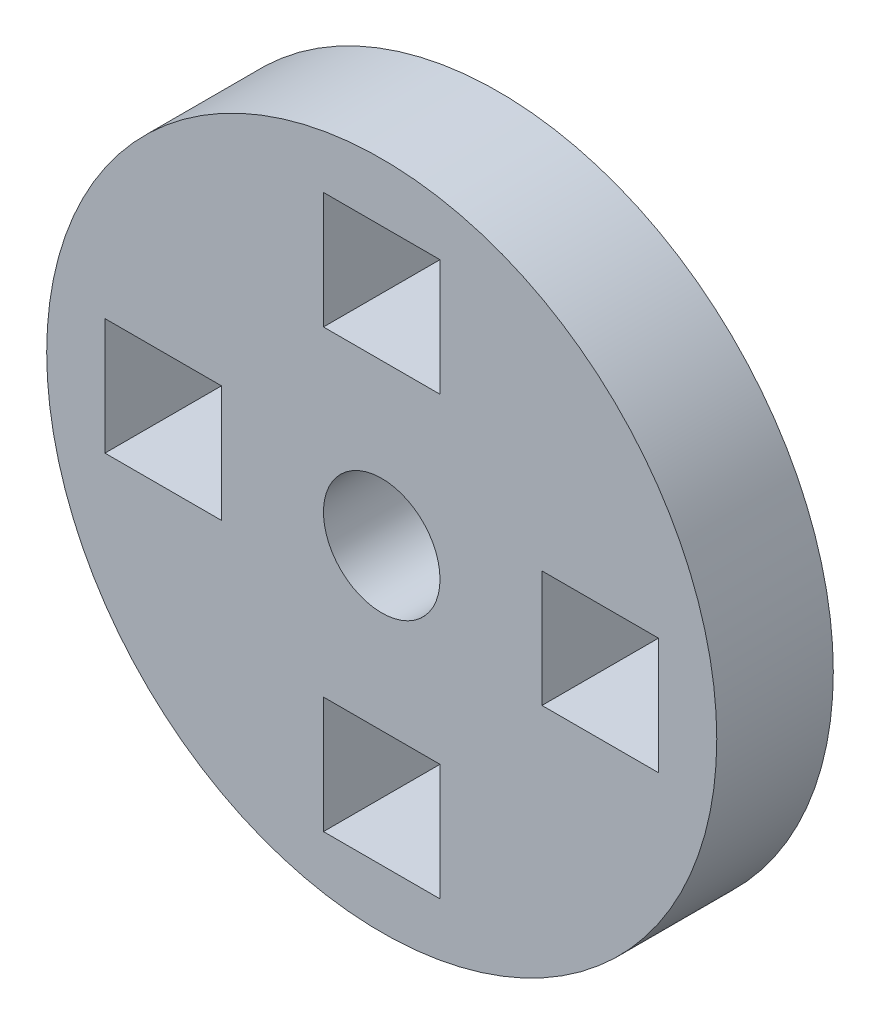
ISO-10303-21;
HEADER;
FILE_DESCRIPTION(('STEP AP214'),'2;1');
FILE_NAME('part.step','',(''),(''),'','','');
FILE_SCHEMA(('AUTOMOTIVE_DESIGN { 1 0 10303 214 1 1 1 1 }'));
ENDSEC;
DATA;
#1=APPLICATION_CONTEXT('core data for automotive mechanical design processes');
#2=APPLICATION_PROTOCOL_DEFINITION('international standard','automotive_design',2000,#1);
#3=PRODUCT_CONTEXT('',#1,'mechanical');
#4=PRODUCT('Part','Part','',(#3));
#5=PRODUCT_RELATED_PRODUCT_CATEGORY('part','',(#4));
#6=PRODUCT_DEFINITION_FORMATION('','',#4);
#7=PRODUCT_DEFINITION_CONTEXT('part definition',#1,'design');
#8=PRODUCT_DEFINITION('design','',#6,#7);
#9=PRODUCT_DEFINITION_SHAPE('','',#8);
#10=(LENGTH_UNIT() NAMED_UNIT(*) SI_UNIT(.MILLI.,.METRE.));
#11=(NAMED_UNIT(*) PLANE_ANGLE_UNIT() SI_UNIT($,.RADIAN.));
#12=(NAMED_UNIT(*) SI_UNIT($,.STERADIAN.) SOLID_ANGLE_UNIT());
#13=UNCERTAINTY_MEASURE_WITH_UNIT(LENGTH_MEASURE(1.E-05),#10,'distance_accuracy_value','');
#14=(GEOMETRIC_REPRESENTATION_CONTEXT(3) GLOBAL_UNCERTAINTY_ASSIGNED_CONTEXT((#13)) GLOBAL_UNIT_ASSIGNED_CONTEXT((#10,
#11,#12)) REPRESENTATION_CONTEXT('',''));
#15=CARTESIAN_POINT('',(0.,0.,0.));
#16=DIRECTION('',(0.,0.,1.));
#17=DIRECTION('',(1.,0.,0.));
#18=AXIS2_PLACEMENT_3D('',#15,#16,#17);
#19=CARTESIAN_POINT('',(0.,0.,4.));
#20=DIRECTION('',(0.,0.,1.));
#21=DIRECTION('',(1.,0.,0.));
#22=AXIS2_PLACEMENT_3D('',#19,#20,#21);
#23=PLANE('',#22);
#24=CARTESIAN_POINT('',(0.,0.,4.));
#25=DIRECTION('',(0.,0.,1.));
#26=DIRECTION('',(1.,0.,0.));
#27=AXIS2_PLACEMENT_3D('',#24,#25,#26);
#28=CIRCLE('',#27,2.);
#29=CARTESIAN_POINT('',(2.,0.,4.));
#30=VERTEX_POINT('',#29);
#31=EDGE_CURVE('E564',#30,#30,#28,.T.);
#32=ORIENTED_EDGE('',*,*,#31,.F.);
#33=EDGE_LOOP('',(#32));
#34=FACE_BOUND('',#33,.T.);
#35=CARTESIAN_POINT('',(0.,0.,4.));
#36=DIRECTION('',(0.,0.,1.));
#37=DIRECTION('',(1.,0.,0.));
#38=AXIS2_PLACEMENT_3D('',#35,#36,#37);
#39=CIRCLE('',#38,11.5);
#40=CARTESIAN_POINT('',(11.5,0.,4.));
#41=VERTEX_POINT('',#40);
#42=EDGE_CURVE('E11',#41,#41,#39,.T.);
#43=ORIENTED_EDGE('',*,*,#42,.T.);
#44=EDGE_LOOP('',(#43));
#45=FACE_BOUND('',#44,.T.);
#46=DIRECTION('',(1.,0.,0.));
#47=VECTOR('',#46,1.);
#48=CARTESIAN_POINT('',(-2.,5.5,4.));
#49=LINE('',#48,#47);
#50=CARTESIAN_POINT('',(-2.,5.5,4.));
#51=VERTEX_POINT('',#50);
#52=CARTESIAN_POINT('',(2.,5.5,4.));
#53=VERTEX_POINT('',#52);
#54=EDGE_CURVE('E291',#51,#53,#49,.T.);
#55=ORIENTED_EDGE('',*,*,#54,.F.);
#56=DIRECTION('',(0.,-1.,0.));
#57=VECTOR('',#56,1.);
#58=CARTESIAN_POINT('',(-2.,9.5,4.));
#59=LINE('',#58,#57);
#60=CARTESIAN_POINT('',(-2.,9.5,4.));
#61=VERTEX_POINT('',#60);
#62=EDGE_CURVE('E288',#61,#51,#59,.T.);
#63=ORIENTED_EDGE('',*,*,#62,.F.);
#64=DIRECTION('',(-1.,0.,0.));
#65=VECTOR('',#64,1.);
#66=CARTESIAN_POINT('',(-2.,9.5,4.));
#67=LINE('',#66,#65);
#68=CARTESIAN_POINT('',(2.,9.5,4.));
#69=VERTEX_POINT('',#68);
#70=EDGE_CURVE('E299',#69,#61,#67,.T.);
#71=ORIENTED_EDGE('',*,*,#70,.F.);
#72=DIRECTION('',(0.,1.,0.));
#73=VECTOR('',#72,1.);
#74=CARTESIAN_POINT('',(2.,9.5,4.));
#75=LINE('',#74,#73);
#76=EDGE_CURVE('E295',#53,#69,#75,.T.);
#77=ORIENTED_EDGE('',*,*,#76,.F.);
#78=EDGE_LOOP('',(#55,#63,#71,#77));
#79=FACE_BOUND('',#78,.T.);
#80=DIRECTION('',(1.,0.,0.));
#81=VECTOR('',#80,1.);
#82=CARTESIAN_POINT('',(-2.,-9.5,4.));
#83=LINE('',#82,#81);
#84=CARTESIAN_POINT('',(-2.,-9.5,4.));
#85=VERTEX_POINT('',#84);
#86=CARTESIAN_POINT('',(2.,-9.5,4.));
#87=VERTEX_POINT('',#86);
#88=EDGE_CURVE('E248',#85,#87,#83,.T.);
#89=ORIENTED_EDGE('',*,*,#88,.F.);
#90=DIRECTION('',(0.,-1.,0.));
#91=VECTOR('',#90,1.);
#92=CARTESIAN_POINT('',(-2.,-5.5,4.));
#93=LINE('',#92,#91);
#94=CARTESIAN_POINT('',(-2.,-5.5,4.));
#95=VERTEX_POINT('',#94);
#96=EDGE_CURVE('E245',#95,#85,#93,.T.);
#97=ORIENTED_EDGE('',*,*,#96,.F.);
#98=DIRECTION('',(-1.,0.,0.));
#99=VECTOR('',#98,1.);
#100=CARTESIAN_POINT('',(-2.,-5.5,4.));
#101=LINE('',#100,#99);
#102=CARTESIAN_POINT('',(2.,-5.5,4.));
#103=VERTEX_POINT('',#102);
#104=EDGE_CURVE('E256',#103,#95,#101,.T.);
#105=ORIENTED_EDGE('',*,*,#104,.F.);
#106=DIRECTION('',(0.,1.,0.));
#107=VECTOR('',#106,1.);
#108=CARTESIAN_POINT('',(2.,-5.5,4.));
#109=LINE('',#108,#107);
#110=EDGE_CURVE('E252',#87,#103,#109,.T.);
#111=ORIENTED_EDGE('',*,*,#110,.F.);
#112=EDGE_LOOP('',(#89,#97,#105,#111));
#113=FACE_BOUND('',#112,.T.);
#114=DIRECTION('',(-1.,0.,0.));
#115=VECTOR('',#114,1.);
#116=CARTESIAN_POINT('',(9.50000000000013,2.00000000000075,4.));
#117=LINE('',#116,#115);
#118=CARTESIAN_POINT('',(9.50000000000013,2.00000000000075,4.));
#119=VERTEX_POINT('',#118);
#120=CARTESIAN_POINT('',(5.50000000000013,2.00000000000061,4.));
#121=VERTEX_POINT('',#120);
#122=EDGE_CURVE('E205',#119,#121,#117,.T.);
#123=ORIENTED_EDGE('',*,*,#122,.F.);
#124=DIRECTION('',(0.,1.,0.));
#125=VECTOR('',#124,1.);
#126=CARTESIAN_POINT('',(9.50000000000013,2.00000000000075,4.));
#127=LINE('',#126,#125);
#128=CARTESIAN_POINT('',(9.50000000000027,-1.99999999999925,4.));
#129=VERTEX_POINT('',#128);
#130=EDGE_CURVE('E202',#129,#119,#127,.T.);
#131=ORIENTED_EDGE('',*,*,#130,.F.);
#132=DIRECTION('',(1.,0.,0.));
#133=VECTOR('',#132,1.);
#134=CARTESIAN_POINT('',(9.50000000000027,-1.99999999999925,4.));
#135=LINE('',#134,#133);
#136=CARTESIAN_POINT('',(5.50000000000027,-1.99999999999939,4.));
#137=VERTEX_POINT('',#136);
#138=EDGE_CURVE('E213',#137,#129,#135,.T.);
#139=ORIENTED_EDGE('',*,*,#138,.F.);
#140=DIRECTION('',(0.,-1.,0.));
#141=VECTOR('',#140,1.);
#142=CARTESIAN_POINT('',(5.50000000000013,2.00000000000061,4.));
#143=LINE('',#142,#141);
#144=EDGE_CURVE('E209',#121,#137,#143,.T.);
#145=ORIENTED_EDGE('',*,*,#144,.F.);
#146=EDGE_LOOP('',(#123,#131,#139,#145));
#147=FACE_BOUND('',#146,.T.);
#148=DIRECTION('',(-1.,0.,0.));
#149=VECTOR('',#148,1.);
#150=CARTESIAN_POINT('',(-5.49999999999999,2.00000000000002,4.));
#151=LINE('',#150,#149);
#152=CARTESIAN_POINT('',(-5.49999999999999,2.00000000000002,4.));
#153=VERTEX_POINT('',#152);
#154=CARTESIAN_POINT('',(-9.49999999999999,2.00000000000003,4.));
#155=VERTEX_POINT('',#154);
#156=EDGE_CURVE('E161',#153,#155,#151,.T.);
#157=ORIENTED_EDGE('',*,*,#156,.F.);
#158=DIRECTION('',(0.,1.,0.));
#159=VECTOR('',#158,1.);
#160=CARTESIAN_POINT('',(-5.49999999999999,2.00000000000002,4.));
#161=LINE('',#160,#159);
#162=CARTESIAN_POINT('',(-5.49999999999973,-1.99999999999977,4.));
#163=VERTEX_POINT('',#162);
#164=EDGE_CURVE('E152',#163,#153,#161,.T.);
#165=ORIENTED_EDGE('',*,*,#164,.F.);
#166=DIRECTION('',(1.,0.,0.));
#167=VECTOR('',#166,1.);
#168=CARTESIAN_POINT('',(-5.49999999999973,-1.99999999999977,4.));
#169=LINE('',#168,#167);
#170=CARTESIAN_POINT('',(-9.49999999999973,-1.99999999999991,4.));
#171=VERTEX_POINT('',#170);
#172=EDGE_CURVE('E178',#171,#163,#169,.T.);
#173=ORIENTED_EDGE('',*,*,#172,.F.);
#174=DIRECTION('',(0.,-1.,0.));
#175=VECTOR('',#174,1.);
#176=CARTESIAN_POINT('',(-9.49999999999999,2.00000000000003,4.));
#177=LINE('',#176,#175);
#178=EDGE_CURVE('E174',#155,#171,#177,.T.);
#179=ORIENTED_EDGE('',*,*,#178,.F.);
#180=EDGE_LOOP('',(#157,#165,#173,#179));
#181=FACE_BOUND('',#180,.T.);
#182=ADVANCED_FACE('F38',(#34,#45,#79,#113,#147,#181),#23,.T.);
#183=CARTESIAN_POINT('',(0.,0.,0.));
#184=DIRECTION('',(0.,0.,1.));
#185=DIRECTION('',(1.,0.,0.));
#186=AXIS2_PLACEMENT_3D('',#183,#184,#185);
#187=PLANE('',#186);
#188=CARTESIAN_POINT('',(0.,0.,0.));
#189=DIRECTION('',(0.,0.,1.));
#190=DIRECTION('',(1.,0.,0.));
#191=AXIS2_PLACEMENT_3D('',#188,#189,#190);
#192=CIRCLE('',#191,2.);
#193=CARTESIAN_POINT('',(2.,0.,0.));
#194=VERTEX_POINT('',#193);
#195=EDGE_CURVE('E186',#194,#194,#192,.T.);
#196=ORIENTED_EDGE('',*,*,#195,.T.);
#197=EDGE_LOOP('',(#196));
#198=FACE_BOUND('',#197,.T.);
#199=DIRECTION('',(0.,1.,0.));
#200=VECTOR('',#199,1.);
#201=CARTESIAN_POINT('',(9.50000000000013,2.00000000000075,0.));
#202=LINE('',#201,#200);
#203=CARTESIAN_POINT('',(9.50000000000027,-1.99999999999925,0.));
#204=VERTEX_POINT('',#203);
#205=CARTESIAN_POINT('',(9.50000000000013,2.00000000000075,0.));
#206=VERTEX_POINT('',#205);
#207=EDGE_CURVE('E170',#204,#206,#202,.T.);
#208=ORIENTED_EDGE('',*,*,#207,.T.);
#209=DIRECTION('',(-1.,0.,0.));
#210=VECTOR('',#209,1.);
#211=CARTESIAN_POINT('',(9.50000000000013,2.00000000000075,0.));
#212=LINE('',#211,#210);
#213=CARTESIAN_POINT('',(5.50000000000013,2.00000000000061,0.));
#214=VERTEX_POINT('',#213);
#215=EDGE_CURVE('E220',#206,#214,#212,.T.);
#216=ORIENTED_EDGE('',*,*,#215,.T.);
#217=DIRECTION('',(0.,-1.,0.));
#218=VECTOR('',#217,1.);
#219=CARTESIAN_POINT('',(5.50000000000013,2.00000000000061,0.));
#220=LINE('',#219,#218);
#221=CARTESIAN_POINT('',(5.50000000000027,-1.99999999999939,0.));
#222=VERTEX_POINT('',#221);
#223=EDGE_CURVE('E224',#214,#222,#220,.T.);
#224=ORIENTED_EDGE('',*,*,#223,.T.);
#225=DIRECTION('',(1.,0.,0.));
#226=VECTOR('',#225,1.);
#227=CARTESIAN_POINT('',(9.50000000000027,-1.99999999999925,0.));
#228=LINE('',#227,#226);
#229=EDGE_CURVE('E206',#222,#204,#228,.T.);
#230=ORIENTED_EDGE('',*,*,#229,.T.);
#231=EDGE_LOOP('',(#208,#216,#224,#230));
#232=FACE_BOUND('',#231,.T.);
#233=DIRECTION('',(0.,-1.,0.));
#234=VECTOR('',#233,1.);
#235=CARTESIAN_POINT('',(-2.,9.5,0.));
#236=LINE('',#235,#234);
#237=CARTESIAN_POINT('',(-2.,9.5,0.));
#238=VERTEX_POINT('',#237);
#239=CARTESIAN_POINT('',(-2.,5.5,0.));
#240=VERTEX_POINT('',#239);
#241=EDGE_CURVE('E287',#238,#240,#236,.T.);
#242=ORIENTED_EDGE('',*,*,#241,.T.);
#243=DIRECTION('',(1.,0.,0.));
#244=VECTOR('',#243,1.);
#245=CARTESIAN_POINT('',(-2.,5.5,0.));
#246=LINE('',#245,#244);
#247=CARTESIAN_POINT('',(2.,5.5,0.));
#248=VERTEX_POINT('',#247);
#249=EDGE_CURVE('E306',#240,#248,#246,.T.);
#250=ORIENTED_EDGE('',*,*,#249,.T.);
#251=DIRECTION('',(0.,1.,0.));
#252=VECTOR('',#251,1.);
#253=CARTESIAN_POINT('',(2.,9.5,0.));
#254=LINE('',#253,#252);
#255=CARTESIAN_POINT('',(2.,9.5,0.));
#256=VERTEX_POINT('',#255);
#257=EDGE_CURVE('E310',#248,#256,#254,.T.);
#258=ORIENTED_EDGE('',*,*,#257,.T.);
#259=DIRECTION('',(-1.,0.,0.));
#260=VECTOR('',#259,1.);
#261=CARTESIAN_POINT('',(-2.,9.5,0.));
#262=LINE('',#261,#260);
#263=EDGE_CURVE('E292',#256,#238,#262,.T.);
#264=ORIENTED_EDGE('',*,*,#263,.T.);
#265=EDGE_LOOP('',(#242,#250,#258,#264));
#266=FACE_BOUND('',#265,.T.);
#267=CARTESIAN_POINT('',(0.,0.,0.));
#268=DIRECTION('',(0.,0.,1.));
#269=DIRECTION('',(1.,0.,0.));
#270=AXIS2_PLACEMENT_3D('',#267,#268,#269);
#271=CIRCLE('',#270,11.5);
#272=CARTESIAN_POINT('',(11.5,0.,0.));
#273=VERTEX_POINT('',#272);
#274=EDGE_CURVE('E42',#273,#273,#271,.T.);
#275=ORIENTED_EDGE('',*,*,#274,.F.);
#276=EDGE_LOOP('',(#275));
#277=FACE_BOUND('',#276,.T.);
#278=DIRECTION('',(0.,-1.,0.));
#279=VECTOR('',#278,1.);
#280=CARTESIAN_POINT('',(-2.,-5.5,0.));
#281=LINE('',#280,#279);
#282=CARTESIAN_POINT('',(-2.,-5.5,0.));
#283=VERTEX_POINT('',#282);
#284=CARTESIAN_POINT('',(-2.,-9.5,0.));
#285=VERTEX_POINT('',#284);
#286=EDGE_CURVE('E244',#283,#285,#281,.T.);
#287=ORIENTED_EDGE('',*,*,#286,.T.);
#288=DIRECTION('',(1.,0.,0.));
#289=VECTOR('',#288,1.);
#290=CARTESIAN_POINT('',(-2.,-9.5,0.));
#291=LINE('',#290,#289);
#292=CARTESIAN_POINT('',(2.,-9.5,0.));
#293=VERTEX_POINT('',#292);
#294=EDGE_CURVE('E263',#285,#293,#291,.T.);
#295=ORIENTED_EDGE('',*,*,#294,.T.);
#296=DIRECTION('',(0.,1.,0.));
#297=VECTOR('',#296,1.);
#298=CARTESIAN_POINT('',(2.,-5.5,0.));
#299=LINE('',#298,#297);
#300=CARTESIAN_POINT('',(2.,-5.5,0.));
#301=VERTEX_POINT('',#300);
#302=EDGE_CURVE('E267',#293,#301,#299,.T.);
#303=ORIENTED_EDGE('',*,*,#302,.T.);
#304=DIRECTION('',(-1.,0.,0.));
#305=VECTOR('',#304,1.);
#306=CARTESIAN_POINT('',(-2.,-5.5,0.));
#307=LINE('',#306,#305);
#308=EDGE_CURVE('E249',#301,#283,#307,.T.);
#309=ORIENTED_EDGE('',*,*,#308,.T.);
#310=EDGE_LOOP('',(#287,#295,#303,#309));
#311=FACE_BOUND('',#310,.T.);
#312=DIRECTION('',(0.,1.,0.));
#313=VECTOR('',#312,1.);
#314=CARTESIAN_POINT('',(-5.49999999999999,2.00000000000002,0.));
#315=LINE('',#314,#313);
#316=CARTESIAN_POINT('',(-5.49999999999973,-1.99999999999977,0.));
#317=VERTEX_POINT('',#316);
#318=CARTESIAN_POINT('',(-5.49999999999999,2.00000000000002,0.));
#319=VERTEX_POINT('',#318);
#320=EDGE_CURVE('E62',#317,#319,#315,.T.);
#321=ORIENTED_EDGE('',*,*,#320,.T.);
#322=DIRECTION('',(-1.,0.,0.));
#323=VECTOR('',#322,1.);
#324=CARTESIAN_POINT('',(-5.49999999999999,2.00000000000002,0.));
#325=LINE('',#324,#323);
#326=CARTESIAN_POINT('',(-9.49999999999999,2.00000000000003,0.));
#327=VERTEX_POINT('',#326);
#328=EDGE_CURVE('E168',#319,#327,#325,.T.);
#329=ORIENTED_EDGE('',*,*,#328,.T.);
#330=DIRECTION('',(0.,-1.,0.));
#331=VECTOR('',#330,1.);
#332=CARTESIAN_POINT('',(-9.49999999999999,2.00000000000003,0.));
#333=LINE('',#332,#331);
#334=CARTESIAN_POINT('',(-9.49999999999973,-1.99999999999991,0.));
#335=VERTEX_POINT('',#334);
#336=EDGE_CURVE('E189',#327,#335,#333,.T.);
#337=ORIENTED_EDGE('',*,*,#336,.T.);
#338=DIRECTION('',(1.,0.,0.));
#339=VECTOR('',#338,1.);
#340=CARTESIAN_POINT('',(-5.49999999999973,-1.99999999999977,0.));
#341=LINE('',#340,#339);
#342=EDGE_CURVE('E162',#335,#317,#341,.T.);
#343=ORIENTED_EDGE('',*,*,#342,.T.);
#344=EDGE_LOOP('',(#321,#329,#337,#343));
#345=FACE_BOUND('',#344,.T.);
#346=ADVANCED_FACE('F336',(#198,#232,#266,#277,#311,#345),#187,.F.);
#347=CARTESIAN_POINT('',(0.,0.,4.));
#348=DIRECTION('',(0.,0.,-1.));
#349=DIRECTION('',(-1.,0.,0.));
#350=AXIS2_PLACEMENT_3D('',#347,#348,#349);
#351=CYLINDRICAL_SURFACE('',#350,11.5);
#352=ORIENTED_EDGE('',*,*,#42,.F.);
#353=EDGE_LOOP('',(#352));
#354=FACE_BOUND('',#353,.T.);
#355=ORIENTED_EDGE('',*,*,#274,.T.);
#356=EDGE_LOOP('',(#355));
#357=FACE_BOUND('',#356,.T.);
#358=ADVANCED_FACE('F40',(#354,#357),#351,.T.);
#359=CARTESIAN_POINT('',(-2.,9.5,4.));
#360=DIRECTION('',(1.,0.,0.));
#361=DIRECTION('',(0.,1.,0.));
#362=AXIS2_PLACEMENT_3D('',#359,#360,#361);
#363=PLANE('',#362);
#364=ORIENTED_EDGE('',*,*,#241,.F.);
#365=DIRECTION('',(0.,0.,-1.));
#366=VECTOR('',#365,1.);
#367=CARTESIAN_POINT('',(-2.,9.5,4.));
#368=LINE('',#367,#366);
#369=EDGE_CURVE('E302',#61,#238,#368,.T.);
#370=ORIENTED_EDGE('',*,*,#369,.F.);
#371=ORIENTED_EDGE('',*,*,#62,.T.);
#372=DIRECTION('',(0.,0.,-1.));
#373=VECTOR('',#372,1.);
#374=CARTESIAN_POINT('',(-2.,5.5,4.));
#375=LINE('',#374,#373);
#376=EDGE_CURVE('E326',#51,#240,#375,.T.);
#377=ORIENTED_EDGE('',*,*,#376,.T.);
#378=EDGE_LOOP('',(#364,#370,#371,#377));
#379=FACE_BOUND('',#378,.T.);
#380=ADVANCED_FACE('F363',(#379),#363,.T.);
#381=CARTESIAN_POINT('',(-2.,5.5,4.));
#382=DIRECTION('',(0.,1.,0.));
#383=DIRECTION('',(-1.,0.,0.));
#384=AXIS2_PLACEMENT_3D('',#381,#382,#383);
#385=PLANE('',#384);
#386=ORIENTED_EDGE('',*,*,#249,.F.);
#387=ORIENTED_EDGE('',*,*,#376,.F.);
#388=ORIENTED_EDGE('',*,*,#54,.T.);
#389=DIRECTION('',(0.,0.,-1.));
#390=VECTOR('',#389,1.);
#391=CARTESIAN_POINT('',(2.,5.5,4.));
#392=LINE('',#391,#390);
#393=EDGE_CURVE('E323',#53,#248,#392,.T.);
#394=ORIENTED_EDGE('',*,*,#393,.T.);
#395=EDGE_LOOP('',(#386,#387,#388,#394));
#396=FACE_BOUND('',#395,.T.);
#397=ADVANCED_FACE('F366',(#396),#385,.T.);
#398=CARTESIAN_POINT('',(2.,9.5,4.));
#399=DIRECTION('',(-1.,0.,0.));
#400=DIRECTION('',(0.,-1.,0.));
#401=AXIS2_PLACEMENT_3D('',#398,#399,#400);
#402=PLANE('',#401);
#403=ORIENTED_EDGE('',*,*,#257,.F.);
#404=ORIENTED_EDGE('',*,*,#393,.F.);
#405=ORIENTED_EDGE('',*,*,#76,.T.);
#406=DIRECTION('',(0.,0.,-1.));
#407=VECTOR('',#406,1.);
#408=CARTESIAN_POINT('',(2.,9.5,4.));
#409=LINE('',#408,#407);
#410=EDGE_CURVE('E320',#69,#256,#409,.T.);
#411=ORIENTED_EDGE('',*,*,#410,.T.);
#412=EDGE_LOOP('',(#403,#404,#405,#411));
#413=FACE_BOUND('',#412,.T.);
#414=ADVANCED_FACE('F369',(#413),#402,.T.);
#415=CARTESIAN_POINT('',(-2.,9.5,4.));
#416=DIRECTION('',(0.,-1.,0.));
#417=DIRECTION('',(0.,0.,-1.));
#418=AXIS2_PLACEMENT_3D('',#415,#416,#417);
#419=PLANE('',#418);
#420=ORIENTED_EDGE('',*,*,#263,.F.);
#421=ORIENTED_EDGE('',*,*,#410,.F.);
#422=ORIENTED_EDGE('',*,*,#70,.T.);
#423=ORIENTED_EDGE('',*,*,#369,.T.);
#424=EDGE_LOOP('',(#420,#421,#422,#423));
#425=FACE_BOUND('',#424,.T.);
#426=ADVANCED_FACE('F373',(#425),#419,.T.);
#427=CARTESIAN_POINT('',(-2.,-5.5,4.));
#428=DIRECTION('',(1.,0.,0.));
#429=DIRECTION('',(0.,1.,0.));
#430=AXIS2_PLACEMENT_3D('',#427,#428,#429);
#431=PLANE('',#430);
#432=ORIENTED_EDGE('',*,*,#286,.F.);
#433=DIRECTION('',(0.,0.,-1.));
#434=VECTOR('',#433,1.);
#435=CARTESIAN_POINT('',(-2.,-5.5,4.));
#436=LINE('',#435,#434);
#437=EDGE_CURVE('E259',#95,#283,#436,.T.);
#438=ORIENTED_EDGE('',*,*,#437,.F.);
#439=ORIENTED_EDGE('',*,*,#96,.T.);
#440=DIRECTION('',(0.,0.,-1.));
#441=VECTOR('',#440,1.);
#442=CARTESIAN_POINT('',(-2.,-9.5,4.));
#443=LINE('',#442,#441);
#444=EDGE_CURVE('E283',#85,#285,#443,.T.);
#445=ORIENTED_EDGE('',*,*,#444,.T.);
#446=EDGE_LOOP('',(#432,#438,#439,#445));
#447=FACE_BOUND('',#446,.T.);
#448=ADVANCED_FACE('F377',(#447),#431,.T.);
#449=CARTESIAN_POINT('',(-2.,-9.5,4.));
#450=DIRECTION('',(0.,1.,0.));
#451=DIRECTION('',(0.,0.,1.));
#452=AXIS2_PLACEMENT_3D('',#449,#450,#451);
#453=PLANE('',#452);
#454=ORIENTED_EDGE('',*,*,#294,.F.);
#455=ORIENTED_EDGE('',*,*,#444,.F.);
#456=ORIENTED_EDGE('',*,*,#88,.T.);
#457=DIRECTION('',(0.,0.,-1.));
#458=VECTOR('',#457,1.);
#459=CARTESIAN_POINT('',(2.,-9.5,4.));
#460=LINE('',#459,#458);
#461=EDGE_CURVE('E280',#87,#293,#460,.T.);
#462=ORIENTED_EDGE('',*,*,#461,.T.);
#463=EDGE_LOOP('',(#454,#455,#456,#462));
#464=FACE_BOUND('',#463,.T.);
#465=ADVANCED_FACE('F381',(#464),#453,.T.);
#466=CARTESIAN_POINT('',(2.,-5.5,4.));
#467=DIRECTION('',(-1.,0.,0.));
#468=DIRECTION('',(0.,-1.,0.));
#469=AXIS2_PLACEMENT_3D('',#466,#467,#468);
#470=PLANE('',#469);
#471=ORIENTED_EDGE('',*,*,#302,.F.);
#472=ORIENTED_EDGE('',*,*,#461,.F.);
#473=ORIENTED_EDGE('',*,*,#110,.T.);
#474=DIRECTION('',(0.,0.,-1.));
#475=VECTOR('',#474,1.);
#476=CARTESIAN_POINT('',(2.,-5.5,4.));
#477=LINE('',#476,#475);
#478=EDGE_CURVE('E277',#103,#301,#477,.T.);
#479=ORIENTED_EDGE('',*,*,#478,.T.);
#480=EDGE_LOOP('',(#471,#472,#473,#479));
#481=FACE_BOUND('',#480,.T.);
#482=ADVANCED_FACE('F385',(#481),#470,.T.);
#483=CARTESIAN_POINT('',(-2.,-5.5,4.));
#484=DIRECTION('',(0.,-1.,0.));
#485=DIRECTION('',(1.,0.,0.));
#486=AXIS2_PLACEMENT_3D('',#483,#484,#485);
#487=PLANE('',#486);
#488=ORIENTED_EDGE('',*,*,#308,.F.);
#489=ORIENTED_EDGE('',*,*,#478,.F.);
#490=ORIENTED_EDGE('',*,*,#104,.T.);
#491=ORIENTED_EDGE('',*,*,#437,.T.);
#492=EDGE_LOOP('',(#488,#489,#490,#491));
#493=FACE_BOUND('',#492,.T.);
#494=ADVANCED_FACE('F389',(#493),#487,.T.);
#495=CARTESIAN_POINT('',(9.50000000000013,2.00000000000075,4.));
#496=DIRECTION('',(-1.,0.,0.));
#497=DIRECTION('',(0.,-1.,0.));
#498=AXIS2_PLACEMENT_3D('',#495,#496,#497);
#499=PLANE('',#498);
#500=ORIENTED_EDGE('',*,*,#207,.F.);
#501=DIRECTION('',(0.,0.,-1.));
#502=VECTOR('',#501,1.);
#503=CARTESIAN_POINT('',(9.50000000000027,-1.99999999999925,4.));
#504=LINE('',#503,#502);
#505=EDGE_CURVE('E216',#129,#204,#504,.T.);
#506=ORIENTED_EDGE('',*,*,#505,.F.);
#507=ORIENTED_EDGE('',*,*,#130,.T.);
#508=DIRECTION('',(0.,0.,-1.));
#509=VECTOR('',#508,1.);
#510=CARTESIAN_POINT('',(9.50000000000013,2.00000000000075,4.));
#511=LINE('',#510,#509);
#512=EDGE_CURVE('E240',#119,#206,#511,.T.);
#513=ORIENTED_EDGE('',*,*,#512,.T.);
#514=EDGE_LOOP('',(#500,#506,#507,#513));
#515=FACE_BOUND('',#514,.T.);
#516=ADVANCED_FACE('F393',(#515),#499,.T.);
#517=CARTESIAN_POINT('',(9.50000000000013,2.00000000000075,4.));
#518=DIRECTION('',(0.,-1.,0.));
#519=DIRECTION('',(1.,0.,0.));
#520=AXIS2_PLACEMENT_3D('',#517,#518,#519);
#521=PLANE('',#520);
#522=ORIENTED_EDGE('',*,*,#215,.F.);
#523=ORIENTED_EDGE('',*,*,#512,.F.);
#524=ORIENTED_EDGE('',*,*,#122,.T.);
#525=DIRECTION('',(0.,0.,-1.));
#526=VECTOR('',#525,1.);
#527=CARTESIAN_POINT('',(5.50000000000013,2.00000000000061,4.));
#528=LINE('',#527,#526);
#529=EDGE_CURVE('E237',#121,#214,#528,.T.);
#530=ORIENTED_EDGE('',*,*,#529,.T.);
#531=EDGE_LOOP('',(#522,#523,#524,#530));
#532=FACE_BOUND('',#531,.T.);
#533=ADVANCED_FACE('F397',(#532),#521,.T.);
#534=CARTESIAN_POINT('',(5.50000000000013,2.00000000000061,4.));
#535=DIRECTION('',(1.,0.,0.));
#536=DIRECTION('',(0.,1.,0.));
#537=AXIS2_PLACEMENT_3D('',#534,#535,#536);
#538=PLANE('',#537);
#539=ORIENTED_EDGE('',*,*,#223,.F.);
#540=ORIENTED_EDGE('',*,*,#529,.F.);
#541=ORIENTED_EDGE('',*,*,#144,.T.);
#542=DIRECTION('',(0.,0.,-1.));
#543=VECTOR('',#542,1.);
#544=CARTESIAN_POINT('',(5.50000000000027,-1.99999999999939,4.));
#545=LINE('',#544,#543);
#546=EDGE_CURVE('E234',#137,#222,#545,.T.);
#547=ORIENTED_EDGE('',*,*,#546,.T.);
#548=EDGE_LOOP('',(#539,#540,#541,#547));
#549=FACE_BOUND('',#548,.T.);
#550=ADVANCED_FACE('F401',(#549),#538,.T.);
#551=CARTESIAN_POINT('',(9.50000000000027,-1.99999999999925,4.));
#552=DIRECTION('',(0.,1.,0.));
#553=DIRECTION('',(-1.,0.,0.));
#554=AXIS2_PLACEMENT_3D('',#551,#552,#553);
#555=PLANE('',#554);
#556=ORIENTED_EDGE('',*,*,#229,.F.);
#557=ORIENTED_EDGE('',*,*,#546,.F.);
#558=ORIENTED_EDGE('',*,*,#138,.T.);
#559=ORIENTED_EDGE('',*,*,#505,.T.);
#560=EDGE_LOOP('',(#556,#557,#558,#559));
#561=FACE_BOUND('',#560,.T.);
#562=ADVANCED_FACE('F405',(#561),#555,.T.);
#563=CARTESIAN_POINT('',(-5.49999999999999,2.00000000000002,4.));
#564=DIRECTION('',(-1.,0.,0.));
#565=DIRECTION('',(0.,-1.,0.));
#566=AXIS2_PLACEMENT_3D('',#563,#564,#565);
#567=PLANE('',#566);
#568=ORIENTED_EDGE('',*,*,#320,.F.);
#569=DIRECTION('',(0.,0.,-1.));
#570=VECTOR('',#569,1.);
#571=CARTESIAN_POINT('',(-5.49999999999973,-1.99999999999977,4.));
#572=LINE('',#571,#570);
#573=EDGE_CURVE('E156',#163,#317,#572,.T.);
#574=ORIENTED_EDGE('',*,*,#573,.F.);
#575=ORIENTED_EDGE('',*,*,#164,.T.);
#576=DIRECTION('',(0.,0.,-1.));
#577=VECTOR('',#576,1.);
#578=CARTESIAN_POINT('',(-5.49999999999999,2.00000000000002,4.));
#579=LINE('',#578,#577);
#580=EDGE_CURVE('E155',#153,#319,#579,.T.);
#581=ORIENTED_EDGE('',*,*,#580,.T.);
#582=EDGE_LOOP('',(#568,#574,#575,#581));
#583=FACE_BOUND('',#582,.T.);
#584=ADVANCED_FACE('F154',(#583),#567,.T.);
#585=CARTESIAN_POINT('',(-5.49999999999999,2.00000000000002,4.));
#586=DIRECTION('',(0.,-1.,0.));
#587=DIRECTION('',(1.,0.,0.));
#588=AXIS2_PLACEMENT_3D('',#585,#586,#587);
#589=PLANE('',#588);
#590=ORIENTED_EDGE('',*,*,#328,.F.);
#591=ORIENTED_EDGE('',*,*,#580,.F.);
#592=ORIENTED_EDGE('',*,*,#156,.T.);
#593=DIRECTION('',(0.,0.,-1.));
#594=VECTOR('',#593,1.);
#595=CARTESIAN_POINT('',(-9.49999999999999,2.00000000000003,4.));
#596=LINE('',#595,#594);
#597=EDGE_CURVE('E171',#155,#327,#596,.T.);
#598=ORIENTED_EDGE('',*,*,#597,.T.);
#599=EDGE_LOOP('',(#590,#591,#592,#598));
#600=FACE_BOUND('',#599,.T.);
#601=ADVANCED_FACE('F165',(#600),#589,.T.);
#602=CARTESIAN_POINT('',(-9.49999999999999,2.00000000000003,4.));
#603=DIRECTION('',(1.,0.,0.));
#604=DIRECTION('',(0.,1.,0.));
#605=AXIS2_PLACEMENT_3D('',#602,#603,#604);
#606=PLANE('',#605);
#607=ORIENTED_EDGE('',*,*,#336,.F.);
#608=ORIENTED_EDGE('',*,*,#597,.F.);
#609=ORIENTED_EDGE('',*,*,#178,.T.);
#610=DIRECTION('',(0.,0.,-1.));
#611=VECTOR('',#610,1.);
#612=CARTESIAN_POINT('',(-9.49999999999973,-1.99999999999991,4.));
#613=LINE('',#612,#611);
#614=EDGE_CURVE('E54',#171,#335,#613,.T.);
#615=ORIENTED_EDGE('',*,*,#614,.T.);
#616=EDGE_LOOP('',(#607,#608,#609,#615));
#617=FACE_BOUND('',#616,.T.);
#618=ADVANCED_FACE('F345',(#617),#606,.T.);
#619=CARTESIAN_POINT('',(-5.49999999999973,-1.99999999999977,4.));
#620=DIRECTION('',(0.,1.,0.));
#621=DIRECTION('',(-1.,0.,0.));
#622=AXIS2_PLACEMENT_3D('',#619,#620,#621);
#623=PLANE('',#622);
#624=ORIENTED_EDGE('',*,*,#342,.F.);
#625=ORIENTED_EDGE('',*,*,#614,.F.);
#626=ORIENTED_EDGE('',*,*,#172,.T.);
#627=ORIENTED_EDGE('',*,*,#573,.T.);
#628=EDGE_LOOP('',(#624,#625,#626,#627));
#629=FACE_BOUND('',#628,.T.);
#630=ADVANCED_FACE('F342',(#629),#623,.T.);
#631=CARTESIAN_POINT('',(0.,0.,0.));
#632=DIRECTION('',(0.,0.,1.));
#633=DIRECTION('',(1.,0.,0.));
#634=AXIS2_PLACEMENT_3D('',#631,#632,#633);
#635=CYLINDRICAL_SURFACE('',#634,2.);
#636=ORIENTED_EDGE('',*,*,#195,.F.);
#637=EDGE_LOOP('',(#636));
#638=FACE_BOUND('',#637,.T.);
#639=ORIENTED_EDGE('',*,*,#31,.T.);
#640=EDGE_LOOP('',(#639));
#641=FACE_BOUND('',#640,.T.);
#642=ADVANCED_FACE('F344',(#638,#641),#635,.F.);
#643=CLOSED_SHELL('',(#182,#346,#358,#380,#397,#414,#426,#448,#465,#482,#494,#516,#533,#550,
#562,#584,#601,#618,#630,#642));
#644=MANIFOLD_SOLID_BREP('B2',#643);
#645=ADVANCED_BREP_SHAPE_REPRESENTATION('',(#18,#644),#14);
#646=SHAPE_DEFINITION_REPRESENTATION(#9,#645);
ENDSEC;
END-ISO-10303-21;
